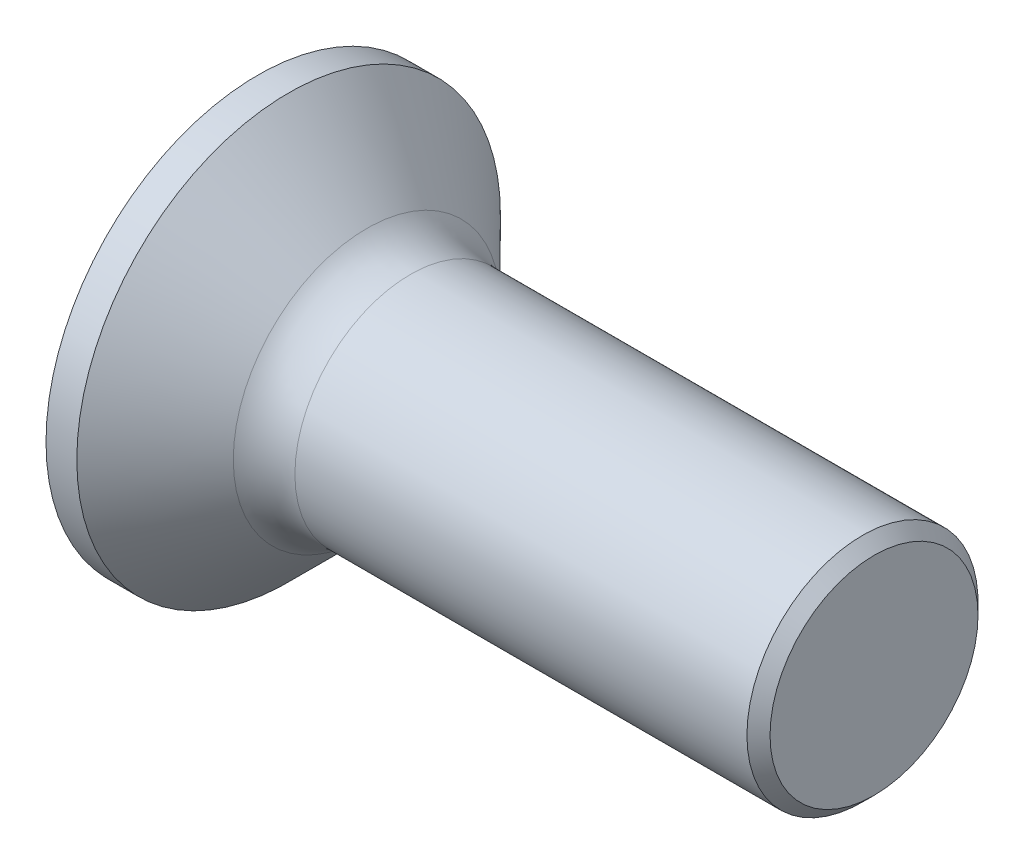
ISO-10303-21;
HEADER;
FILE_DESCRIPTION(('STEP AP214'),'2;1');
FILE_NAME('part.step','',(''),(''),'','','');
FILE_SCHEMA(('AUTOMOTIVE_DESIGN { 1 0 10303 214 1 1 1 1 }'));
ENDSEC;
DATA;
#1=APPLICATION_CONTEXT('core data for automotive mechanical design processes');
#2=APPLICATION_PROTOCOL_DEFINITION('international standard','automotive_design',2000,#1);
#3=PRODUCT_CONTEXT('',#1,'mechanical');
#4=PRODUCT('Part','Part','',(#3));
#5=PRODUCT_RELATED_PRODUCT_CATEGORY('part','',(#4));
#6=PRODUCT_DEFINITION_FORMATION('','',#4);
#7=PRODUCT_DEFINITION_CONTEXT('part definition',#1,'design');
#8=PRODUCT_DEFINITION('design','',#6,#7);
#9=PRODUCT_DEFINITION_SHAPE('','',#8);
#10=(LENGTH_UNIT() NAMED_UNIT(*) SI_UNIT(.MILLI.,.METRE.));
#11=(NAMED_UNIT(*) PLANE_ANGLE_UNIT() SI_UNIT($,.RADIAN.));
#12=(NAMED_UNIT(*) SI_UNIT($,.STERADIAN.) SOLID_ANGLE_UNIT());
#13=UNCERTAINTY_MEASURE_WITH_UNIT(LENGTH_MEASURE(1.E-05),#10,'distance_accuracy_value','');
#14=(GEOMETRIC_REPRESENTATION_CONTEXT(3) GLOBAL_UNCERTAINTY_ASSIGNED_CONTEXT((#13)) GLOBAL_UNIT_ASSIGNED_CONTEXT((#10,
#11,#12)) REPRESENTATION_CONTEXT('',''));
#15=CARTESIAN_POINT('',(0.,0.,0.));
#16=DIRECTION('',(0.,0.,1.));
#17=DIRECTION('',(1.,0.,0.));
#18=AXIS2_PLACEMENT_3D('',#15,#16,#17);
#19=CARTESIAN_POINT('',(0.,0.,-0.425));
#20=DIRECTION('',(0.,0.,1.));
#21=DIRECTION('',(1.,0.,0.));
#22=AXIS2_PLACEMENT_3D('',#19,#20,#21);
#23=PLANE('',#22);
#24=DIRECTION('',(1.,0.,0.));
#25=VECTOR('',#24,1.);
#26=CARTESIAN_POINT('',(0.,-0.419753086419753,-0.425));
#27=LINE('',#26,#25);
#28=CARTESIAN_POINT('',(2.5245,-0.419753086419753,-0.425));
#29=VERTEX_POINT('',#28);
#30=CARTESIAN_POINT('',(1.,-0.419753086419753,-0.425));
#31=VERTEX_POINT('',#30);
#32=EDGE_CURVE('E398',#29,#31,#27,.F.);
#33=ORIENTED_EDGE('',*,*,#32,.T.);
#34=DIRECTION('',(0.,1.,0.));
#35=VECTOR('',#34,1.);
#36=CARTESIAN_POINT('',(1.,0.,-0.425));
#37=LINE('',#36,#35);
#38=CARTESIAN_POINT('',(1.,-0.55003270446328,-0.425));
#39=VERTEX_POINT('',#38);
#40=EDGE_CURVE('E225',#31,#39,#37,.F.);
#41=ORIENTED_EDGE('',*,*,#40,.T.);
#42=DIRECTION('',(1.,0.,0.));
#43=VECTOR('',#42,1.);
#44=CARTESIAN_POINT('',(0.,-0.55003270446328,-0.425));
#45=LINE('',#44,#43);
#46=CARTESIAN_POINT('',(0.,-0.55003270446328,-0.425));
#47=VERTEX_POINT('',#46);
#48=EDGE_CURVE('E199',#39,#47,#45,.F.);
#49=ORIENTED_EDGE('',*,*,#48,.T.);
#50=DIRECTION('',(0.,1.,0.));
#51=VECTOR('',#50,1.);
#52=CARTESIAN_POINT('',(0.,0.,-0.425));
#53=LINE('',#52,#51);
#54=CARTESIAN_POINT('',(0.,-1.7,-0.425));
#55=VERTEX_POINT('',#54);
#56=EDGE_CURVE('E206',#47,#55,#53,.F.);
#57=ORIENTED_EDGE('',*,*,#56,.T.);
#58=DIRECTION('',(1.,0.,0.));
#59=VECTOR('',#58,1.);
#60=CARTESIAN_POINT('',(0.,-1.7,-0.425));
#61=LINE('',#60,#59);
#62=CARTESIAN_POINT('',(0.825,-1.7,-0.425));
#63=VERTEX_POINT('',#62);
#64=EDGE_CURVE('E215',#55,#63,#61,.T.);
#65=ORIENTED_EDGE('',*,*,#64,.T.);
#66=DIRECTION('',(0.799915270195533,0.600112956457372,0.));
#67=VECTOR('',#66,1.);
#68=CARTESIAN_POINT('',(0.825,-1.7,-0.425));
#69=LINE('',#68,#67);
#70=CARTESIAN_POINT('',(2.5245,-0.425,-0.425));
#71=VERTEX_POINT('',#70);
#72=EDGE_CURVE('E392',#63,#71,#69,.T.);
#73=ORIENTED_EDGE('',*,*,#72,.T.);
#74=DIRECTION('',(0.,1.,0.));
#75=VECTOR('',#74,1.);
#76=CARTESIAN_POINT('',(2.5245,0.,-0.425));
#77=LINE('',#76,#75);
#78=EDGE_CURVE('E400',#71,#29,#77,.T.);
#79=ORIENTED_EDGE('',*,*,#78,.T.);
#80=EDGE_LOOP('',(#33,#41,#49,#57,#65,#73,#79));
#81=FACE_BOUND('',#80,.T.);
#82=ADVANCED_FACE('F15',(#81),#23,.T.);
#83=CARTESIAN_POINT('',(0.825,-1.7,0.425));
#84=DIRECTION('',(0.600112956457372,-0.799915270195533,0.));
#85=DIRECTION('',(0.799915270195533,0.600112956457372,0.));
#86=AXIS2_PLACEMENT_3D('',#83,#84,#85);
#87=PLANE('',#86);
#88=DIRECTION('',(0.,0.,1.));
#89=VECTOR('',#88,1.);
#90=CARTESIAN_POINT('',(0.825,-1.7,0.425));
#91=LINE('',#90,#89);
#92=CARTESIAN_POINT('',(0.825,-1.7,0.425));
#93=VERTEX_POINT('',#92);
#94=EDGE_CURVE('E395',#93,#63,#91,.F.);
#95=ORIENTED_EDGE('',*,*,#94,.F.);
#96=DIRECTION('',(0.799915270195533,0.600112956457372,0.));
#97=VECTOR('',#96,1.);
#98=CARTESIAN_POINT('',(0.825,-1.7,0.425));
#99=LINE('',#98,#97);
#100=CARTESIAN_POINT('',(2.5245,-0.425,0.425));
#101=VERTEX_POINT('',#100);
#102=EDGE_CURVE('E383',#93,#101,#99,.T.);
#103=ORIENTED_EDGE('',*,*,#102,.T.);
#104=DIRECTION('',(0.,0.,-1.));
#105=VECTOR('',#104,1.);
#106=CARTESIAN_POINT('',(2.5245,-0.425,0.425));
#107=LINE('',#106,#105);
#108=EDGE_CURVE('E389',#101,#71,#107,.T.);
#109=ORIENTED_EDGE('',*,*,#108,.T.);
#110=ORIENTED_EDGE('',*,*,#72,.F.);
#111=EDGE_LOOP('',(#95,#103,#109,#110));
#112=FACE_BOUND('',#111,.T.);
#113=ADVANCED_FACE('F406',(#112),#87,.F.);
#114=CARTESIAN_POINT('',(2.5245,-0.425,0.425));
#115=DIRECTION('',(1.,0.,0.));
#116=DIRECTION('',(0.,0.,-1.));
#117=AXIS2_PLACEMENT_3D('',#114,#115,#116);
#118=PLANE('',#117);
#119=ORIENTED_EDGE('',*,*,#78,.F.);
#120=ORIENTED_EDGE('',*,*,#108,.F.);
#121=DIRECTION('',(0.,1.,0.));
#122=VECTOR('',#121,1.);
#123=CARTESIAN_POINT('',(2.5245,0.,0.425));
#124=LINE('',#123,#122);
#125=CARTESIAN_POINT('',(2.5245,-0.419753086419753,0.425));
#126=VERTEX_POINT('',#125);
#127=EDGE_CURVE('E381',#101,#126,#124,.T.);
#128=ORIENTED_EDGE('',*,*,#127,.T.);
#129=DIRECTION('',(0.,0.,1.));
#130=VECTOR('',#129,1.);
#131=CARTESIAN_POINT('',(2.5245,-0.419753086419753,0.));
#132=LINE('',#131,#130);
#133=EDGE_CURVE('E357',#29,#126,#132,.T.);
#134=ORIENTED_EDGE('',*,*,#133,.F.);
#135=EDGE_LOOP('',(#119,#120,#128,#134));
#136=FACE_BOUND('',#135,.T.);
#137=ADVANCED_FACE('F411',(#136),#118,.F.);
#138=CARTESIAN_POINT('',(0.,0.,0.425));
#139=DIRECTION('',(0.,0.,1.));
#140=DIRECTION('',(1.,0.,0.));
#141=AXIS2_PLACEMENT_3D('',#138,#139,#140);
#142=PLANE('',#141);
#143=DIRECTION('',(0.,1.,0.));
#144=VECTOR('',#143,1.);
#145=CARTESIAN_POINT('',(1.,0.,0.425));
#146=LINE('',#145,#144);
#147=CARTESIAN_POINT('',(1.,-0.419753086419753,0.425));
#148=VERTEX_POINT('',#147);
#149=CARTESIAN_POINT('',(1.,-0.55003270446328,0.425));
#150=VERTEX_POINT('',#149);
#151=EDGE_CURVE('E379',#148,#150,#146,.F.);
#152=ORIENTED_EDGE('',*,*,#151,.F.);
#153=DIRECTION('',(1.,0.,0.));
#154=VECTOR('',#153,1.);
#155=CARTESIAN_POINT('',(0.,-0.419753086419753,0.425));
#156=LINE('',#155,#154);
#157=EDGE_CURVE('E354',#126,#148,#156,.F.);
#158=ORIENTED_EDGE('',*,*,#157,.F.);
#159=ORIENTED_EDGE('',*,*,#127,.F.);
#160=ORIENTED_EDGE('',*,*,#102,.F.);
#161=DIRECTION('',(1.,0.,0.));
#162=VECTOR('',#161,1.);
#163=CARTESIAN_POINT('',(0.,-1.7,0.425));
#164=LINE('',#163,#162);
#165=CARTESIAN_POINT('',(0.,-1.7,0.425));
#166=VERTEX_POINT('',#165);
#167=EDGE_CURVE('E385',#166,#93,#164,.T.);
#168=ORIENTED_EDGE('',*,*,#167,.F.);
#169=DIRECTION('',(0.,1.,0.));
#170=VECTOR('',#169,1.);
#171=CARTESIAN_POINT('',(0.,0.,0.425));
#172=LINE('',#171,#170);
#173=CARTESIAN_POINT('',(0.,-0.55003270446328,0.425));
#174=VERTEX_POINT('',#173);
#175=EDGE_CURVE('E387',#174,#166,#172,.F.);
#176=ORIENTED_EDGE('',*,*,#175,.F.);
#177=DIRECTION('',(1.,0.,0.));
#178=VECTOR('',#177,1.);
#179=CARTESIAN_POINT('',(0.,-0.55003270446328,0.425));
#180=LINE('',#179,#178);
#181=EDGE_CURVE('E377',#150,#174,#180,.F.);
#182=ORIENTED_EDGE('',*,*,#181,.F.);
#183=EDGE_LOOP('',(#152,#158,#159,#160,#168,#176,#182));
#184=FACE_BOUND('',#183,.T.);
#185=ADVANCED_FACE('F415',(#184),#142,.F.);
#186=CARTESIAN_POINT('',(0.,0.,-0.425));
#187=DIRECTION('',(0.,0.,1.));
#188=DIRECTION('',(1.,0.,0.));
#189=AXIS2_PLACEMENT_3D('',#186,#187,#188);
#190=PLANE('',#189);
#191=DIRECTION('',(1.,0.,0.));
#192=VECTOR('',#191,1.);
#193=CARTESIAN_POINT('',(0.,1.7,-0.425));
#194=LINE('',#193,#192);
#195=CARTESIAN_POINT('',(0.825,1.7,-0.425));
#196=VERTEX_POINT('',#195);
#197=CARTESIAN_POINT('',(0.,1.7,-0.425));
#198=VERTEX_POINT('',#197);
#199=EDGE_CURVE('E363',#196,#198,#194,.F.);
#200=ORIENTED_EDGE('',*,*,#199,.T.);
#201=DIRECTION('',(0.,1.,0.));
#202=VECTOR('',#201,1.);
#203=CARTESIAN_POINT('',(0.,0.,-0.425));
#204=LINE('',#203,#202);
#205=CARTESIAN_POINT('',(0.,0.55003270446328,-0.425));
#206=VERTEX_POINT('',#205);
#207=EDGE_CURVE('E360',#198,#206,#204,.F.);
#208=ORIENTED_EDGE('',*,*,#207,.T.);
#209=DIRECTION('',(1.,0.,0.));
#210=VECTOR('',#209,1.);
#211=CARTESIAN_POINT('',(0.,0.55003270446328,-0.425));
#212=LINE('',#211,#210);
#213=CARTESIAN_POINT('',(1.,0.55003270446328,-0.425));
#214=VERTEX_POINT('',#213);
#215=EDGE_CURVE('E374',#206,#214,#212,.T.);
#216=ORIENTED_EDGE('',*,*,#215,.T.);
#217=DIRECTION('',(0.,1.,0.));
#218=VECTOR('',#217,1.);
#219=CARTESIAN_POINT('',(1.,0.,-0.425));
#220=LINE('',#219,#218);
#221=CARTESIAN_POINT('',(1.,0.419753086419753,-0.425));
#222=VERTEX_POINT('',#221);
#223=EDGE_CURVE('E371',#214,#222,#220,.F.);
#224=ORIENTED_EDGE('',*,*,#223,.T.);
#225=DIRECTION('',(1.,0.,0.));
#226=VECTOR('',#225,1.);
#227=CARTESIAN_POINT('',(0.,0.419753086419753,-0.425));
#228=LINE('',#227,#226);
#229=CARTESIAN_POINT('',(2.5245,0.419753086419753,-0.425));
#230=VERTEX_POINT('',#229);
#231=EDGE_CURVE('E368',#222,#230,#228,.T.);
#232=ORIENTED_EDGE('',*,*,#231,.T.);
#233=DIRECTION('',(0.,1.,0.));
#234=VECTOR('',#233,1.);
#235=CARTESIAN_POINT('',(2.5245,0.,-0.425));
#236=LINE('',#235,#234);
#237=CARTESIAN_POINT('',(2.5245,0.425,-0.425));
#238=VERTEX_POINT('',#237);
#239=EDGE_CURVE('E366',#230,#238,#236,.T.);
#240=ORIENTED_EDGE('',*,*,#239,.T.);
#241=DIRECTION('',(-0.799915270195533,0.600112956457372,0.));
#242=VECTOR('',#241,1.);
#243=CARTESIAN_POINT('',(2.5245,0.425,-0.425));
#244=LINE('',#243,#242);
#245=EDGE_CURVE('E335',#238,#196,#244,.T.);
#246=ORIENTED_EDGE('',*,*,#245,.T.);
#247=EDGE_LOOP('',(#200,#208,#216,#224,#232,#240,#246));
#248=FACE_BOUND('',#247,.T.);
#249=ADVANCED_FACE('F463',(#248),#190,.T.);
#250=CARTESIAN_POINT('',(0.,-0.419753086419753,0.));
#251=DIRECTION('',(0.,1.,0.));
#252=DIRECTION('',(0.,0.,1.));
#253=AXIS2_PLACEMENT_3D('',#250,#251,#252);
#254=PLANE('',#253);
#255=DIRECTION('',(0.,0.,1.));
#256=VECTOR('',#255,1.);
#257=CARTESIAN_POINT('',(0.,-0.419753086419753,0.));
#258=LINE('',#257,#256);
#259=CARTESIAN_POINT('',(0.,-0.419753086419753,-1.7));
#260=VERTEX_POINT('',#259);
#261=CARTESIAN_POINT('',(0.,-0.419753086419753,-0.545630021213276));
#262=VERTEX_POINT('',#261);
#263=EDGE_CURVE('E340',#260,#262,#258,.T.);
#264=ORIENTED_EDGE('',*,*,#263,.T.);
#265=DIRECTION('',(1.,0.,0.));
#266=VECTOR('',#265,1.);
#267=CARTESIAN_POINT('',(0.,-0.419753086419753,-0.545630021213276));
#268=LINE('',#267,#266);
#269=CARTESIAN_POINT('',(1.,-0.419753086419753,-0.545630021213276));
#270=VERTEX_POINT('',#269);
#271=EDGE_CURVE('E338',#262,#270,#268,.T.);
#272=ORIENTED_EDGE('',*,*,#271,.T.);
#273=DIRECTION('',(0.,0.,1.));
#274=VECTOR('',#273,1.);
#275=CARTESIAN_POINT('',(1.,-0.419753086419753,0.));
#276=LINE('',#275,#274);
#277=EDGE_CURVE('E329',#31,#270,#276,.F.);
#278=ORIENTED_EDGE('',*,*,#277,.F.);
#279=ORIENTED_EDGE('',*,*,#32,.F.);
#280=ORIENTED_EDGE('',*,*,#133,.T.);
#281=ORIENTED_EDGE('',*,*,#157,.T.);
#282=DIRECTION('',(0.,0.,1.));
#283=VECTOR('',#282,1.);
#284=CARTESIAN_POINT('',(1.,-0.419753086419753,0.));
#285=LINE('',#284,#283);
#286=CARTESIAN_POINT('',(1.,-0.419753086419753,0.545630021213276));
#287=VERTEX_POINT('',#286);
#288=EDGE_CURVE('E332',#287,#148,#285,.F.);
#289=ORIENTED_EDGE('',*,*,#288,.F.);
#290=DIRECTION('',(1.,0.,0.));
#291=VECTOR('',#290,1.);
#292=CARTESIAN_POINT('',(0.,-0.419753086419753,0.545630021213276));
#293=LINE('',#292,#291);
#294=CARTESIAN_POINT('',(0.,-0.419753086419753,0.545630021213276));
#295=VERTEX_POINT('',#294);
#296=EDGE_CURVE('E351',#287,#295,#293,.F.);
#297=ORIENTED_EDGE('',*,*,#296,.T.);
#298=DIRECTION('',(0.,0.,1.));
#299=VECTOR('',#298,1.);
#300=CARTESIAN_POINT('',(0.,-0.419753086419753,0.));
#301=LINE('',#300,#299);
#302=CARTESIAN_POINT('',(0.,-0.419753086419753,1.7));
#303=VERTEX_POINT('',#302);
#304=EDGE_CURVE('E348',#295,#303,#301,.T.);
#305=ORIENTED_EDGE('',*,*,#304,.T.);
#306=DIRECTION('',(1.,0.,0.));
#307=VECTOR('',#306,1.);
#308=CARTESIAN_POINT('',(0.,-0.419753086419753,1.7));
#309=LINE('',#308,#307);
#310=CARTESIAN_POINT('',(0.825,-0.419753086419753,1.7));
#311=VERTEX_POINT('',#310);
#312=EDGE_CURVE('E346',#303,#311,#309,.T.);
#313=ORIENTED_EDGE('',*,*,#312,.T.);
#314=DIRECTION('',(0.802769432970874,0.,-0.596289558425788));
#315=VECTOR('',#314,1.);
#316=CARTESIAN_POINT('',(0.825,-0.419753086419753,1.7));
#317=LINE('',#316,#315);
#318=CARTESIAN_POINT('',(2.5415,-0.419753086419753,0.425));
#319=VERTEX_POINT('',#318);
#320=EDGE_CURVE('E325',#311,#319,#317,.T.);
#321=ORIENTED_EDGE('',*,*,#320,.T.);
#322=DIRECTION('',(0.,0.,-1.));
#323=VECTOR('',#322,1.);
#324=CARTESIAN_POINT('',(2.5415,-0.419753086419753,0.425));
#325=LINE('',#324,#323);
#326=CARTESIAN_POINT('',(2.5415,-0.419753086419753,-0.425));
#327=VERTEX_POINT('',#326);
#328=EDGE_CURVE('E320',#319,#327,#325,.T.);
#329=ORIENTED_EDGE('',*,*,#328,.T.);
#330=DIRECTION('',(-0.802769432970874,0.,-0.596289558425788));
#331=VECTOR('',#330,1.);
#332=CARTESIAN_POINT('',(2.5415,-0.419753086419753,-0.425));
#333=LINE('',#332,#331);
#334=CARTESIAN_POINT('',(0.825,-0.419753086419753,-1.7));
#335=VERTEX_POINT('',#334);
#336=EDGE_CURVE('E314',#327,#335,#333,.T.);
#337=ORIENTED_EDGE('',*,*,#336,.T.);
#338=DIRECTION('',(1.,0.,0.));
#339=VECTOR('',#338,1.);
#340=CARTESIAN_POINT('',(0.,-0.419753086419753,-1.7));
#341=LINE('',#340,#339);
#342=EDGE_CURVE('E343',#335,#260,#341,.F.);
#343=ORIENTED_EDGE('',*,*,#342,.T.);
#344=EDGE_LOOP('',(#264,#272,#278,#279,#280,#281,#289,#297,#305,#313,#321,#329,#337,#343));
#345=FACE_BOUND('',#344,.T.);
#346=ADVANCED_FACE('F420',(#345),#254,.T.);
#347=CARTESIAN_POINT('',(2.5245,0.425,0.425));
#348=DIRECTION('',(0.600112956457372,0.799915270195533,0.));
#349=DIRECTION('',(-0.799915270195533,0.600112956457372,0.));
#350=AXIS2_PLACEMENT_3D('',#347,#348,#349);
#351=PLANE('',#350);
#352=DIRECTION('',(0.,0.,-1.));
#353=VECTOR('',#352,1.);
#354=CARTESIAN_POINT('',(2.5245,0.425,0.425));
#355=LINE('',#354,#353);
#356=CARTESIAN_POINT('',(2.5245,0.425,0.425));
#357=VERTEX_POINT('',#356);
#358=EDGE_CURVE('E327',#238,#357,#355,.F.);
#359=ORIENTED_EDGE('',*,*,#358,.T.);
#360=DIRECTION('',(-0.799915270195533,0.600112956457372,0.));
#361=VECTOR('',#360,1.);
#362=CARTESIAN_POINT('',(2.5245,0.425,0.425));
#363=LINE('',#362,#361);
#364=CARTESIAN_POINT('',(0.825,1.7,0.425));
#365=VERTEX_POINT('',#364);
#366=EDGE_CURVE('E302',#357,#365,#363,.T.);
#367=ORIENTED_EDGE('',*,*,#366,.T.);
#368=DIRECTION('',(0.,0.,1.));
#369=VECTOR('',#368,1.);
#370=CARTESIAN_POINT('',(0.825,1.7,0.425));
#371=LINE('',#370,#369);
#372=EDGE_CURVE('E309',#365,#196,#371,.F.);
#373=ORIENTED_EDGE('',*,*,#372,.T.);
#374=ORIENTED_EDGE('',*,*,#245,.F.);
#375=EDGE_LOOP('',(#359,#367,#373,#374));
#376=FACE_BOUND('',#375,.T.);
#377=ADVANCED_FACE('F590',(#376),#351,.F.);
#378=CARTESIAN_POINT('',(1.,0.,0.));
#379=DIRECTION('',(-1.,0.,0.));
#380=DIRECTION('',(0.,0.,1.));
#381=AXIS2_PLACEMENT_3D('',#378,#379,#380);
#382=PLANE('',#381);
#383=DIRECTION('',(0.,-0.766044443118978,0.642787609686539));
#384=VECTOR('',#383,1.);
#385=CARTESIAN_POINT('',(1.,-1.20208152801713,1.20208152801713));
#386=LINE('',#385,#384);
#387=CARTESIAN_POINT('',(1.,-1.20208152801713,1.20208152801713));
#388=VERTEX_POINT('',#387);
#389=EDGE_CURVE('E287',#388,#287,#386,.F.);
#390=ORIENTED_EDGE('',*,*,#389,.T.);
#391=ORIENTED_EDGE('',*,*,#288,.T.);
#392=ORIENTED_EDGE('',*,*,#151,.T.);
#393=DIRECTION('',(0.,0.642787609686539,-0.766044443118978));
#394=VECTOR('',#393,1.);
#395=CARTESIAN_POINT('',(1.,-0.193415361212936,0.));
#396=LINE('',#395,#394);
#397=EDGE_CURVE('E285',#150,#388,#396,.F.);
#398=ORIENTED_EDGE('',*,*,#397,.T.);
#399=EDGE_LOOP('',(#390,#391,#392,#398));
#400=FACE_BOUND('',#399,.T.);
#401=ADVANCED_FACE('F587',(#400),#382,.T.);
#402=CARTESIAN_POINT('',(1.,0.,0.));
#403=DIRECTION('',(-1.,0.,0.));
#404=DIRECTION('',(0.,0.,1.));
#405=AXIS2_PLACEMENT_3D('',#402,#403,#404);
#406=PLANE('',#405);
#407=DIRECTION('',(0.,0.766044443118978,0.642787609686539));
#408=VECTOR('',#407,1.);
#409=CARTESIAN_POINT('',(1.,0.,-0.193415361212936));
#410=LINE('',#409,#408);
#411=CARTESIAN_POINT('',(1.,-1.20208152801713,-1.20208152801713));
#412=VERTEX_POINT('',#411);
#413=EDGE_CURVE('E279',#270,#412,#410,.F.);
#414=ORIENTED_EDGE('',*,*,#413,.T.);
#415=DIRECTION('',(0.,-0.642787609686539,-0.766044443118978));
#416=VECTOR('',#415,1.);
#417=CARTESIAN_POINT('',(1.,-1.20208152801713,-1.20208152801713));
#418=LINE('',#417,#416);
#419=EDGE_CURVE('E281',#412,#39,#418,.F.);
#420=ORIENTED_EDGE('',*,*,#419,.T.);
#421=ORIENTED_EDGE('',*,*,#40,.F.);
#422=ORIENTED_EDGE('',*,*,#277,.T.);
#423=EDGE_LOOP('',(#414,#420,#421,#422));
#424=FACE_BOUND('',#423,.T.);
#425=ADVANCED_FACE('F424',(#424),#406,.T.);
#426=CARTESIAN_POINT('',(2.5245,-0.425,0.425));
#427=DIRECTION('',(1.,0.,0.));
#428=DIRECTION('',(0.,0.,-1.));
#429=AXIS2_PLACEMENT_3D('',#426,#427,#428);
#430=PLANE('',#429);
#431=DIRECTION('',(0.,1.,0.));
#432=VECTOR('',#431,1.);
#433=CARTESIAN_POINT('',(2.5245,0.,0.425));
#434=LINE('',#433,#432);
#435=CARTESIAN_POINT('',(2.5245,0.419753086419753,0.425));
#436=VERTEX_POINT('',#435);
#437=EDGE_CURVE('E304',#436,#357,#434,.T.);
#438=ORIENTED_EDGE('',*,*,#437,.T.);
#439=ORIENTED_EDGE('',*,*,#358,.F.);
#440=ORIENTED_EDGE('',*,*,#239,.F.);
#441=DIRECTION('',(0.,0.,1.));
#442=VECTOR('',#441,1.);
#443=CARTESIAN_POINT('',(2.5245,0.419753086419753,0.));
#444=LINE('',#443,#442);
#445=EDGE_CURVE('E273',#230,#436,#444,.T.);
#446=ORIENTED_EDGE('',*,*,#445,.T.);
#447=EDGE_LOOP('',(#438,#439,#440,#446));
#448=FACE_BOUND('',#447,.T.);
#449=ADVANCED_FACE('F580',(#448),#430,.F.);
#450=CARTESIAN_POINT('',(1.,0.,0.));
#451=DIRECTION('',(-1.,0.,0.));
#452=DIRECTION('',(0.,0.,1.));
#453=AXIS2_PLACEMENT_3D('',#450,#451,#452);
#454=PLANE('',#453);
#455=DIRECTION('',(0.,-0.766044443118978,-0.642787609686539));
#456=VECTOR('',#455,1.);
#457=CARTESIAN_POINT('',(1.,0.,0.193415361212936));
#458=LINE('',#457,#456);
#459=CARTESIAN_POINT('',(1.,0.419753086419753,0.545630021213276));
#460=VERTEX_POINT('',#459);
#461=CARTESIAN_POINT('',(1.,1.20208152801713,1.20208152801713));
#462=VERTEX_POINT('',#461);
#463=EDGE_CURVE('E294',#460,#462,#458,.F.);
#464=ORIENTED_EDGE('',*,*,#463,.T.);
#465=DIRECTION('',(0.,0.642787609686539,0.766044443118978));
#466=VECTOR('',#465,1.);
#467=CARTESIAN_POINT('',(1.,1.20208152801713,1.20208152801713));
#468=LINE('',#467,#466);
#469=CARTESIAN_POINT('',(1.,0.55003270446328,0.425));
#470=VERTEX_POINT('',#469);
#471=EDGE_CURVE('E298',#462,#470,#468,.F.);
#472=ORIENTED_EDGE('',*,*,#471,.T.);
#473=DIRECTION('',(0.,1.,0.));
#474=VECTOR('',#473,1.);
#475=CARTESIAN_POINT('',(1.,0.,0.425));
#476=LINE('',#475,#474);
#477=CARTESIAN_POINT('',(1.,0.419753086419753,0.425));
#478=VERTEX_POINT('',#477);
#479=EDGE_CURVE('E307',#470,#478,#476,.F.);
#480=ORIENTED_EDGE('',*,*,#479,.T.);
#481=DIRECTION('',(0.,0.,1.));
#482=VECTOR('',#481,1.);
#483=CARTESIAN_POINT('',(1.,0.419753086419753,0.));
#484=LINE('',#483,#482);
#485=EDGE_CURVE('E268',#478,#460,#484,.T.);
#486=ORIENTED_EDGE('',*,*,#485,.T.);
#487=EDGE_LOOP('',(#464,#472,#480,#486));
#488=FACE_BOUND('',#487,.T.);
#489=ADVANCED_FACE('F577',(#488),#454,.T.);
#490=CARTESIAN_POINT('',(0.825,0.419753086419753,1.7));
#491=DIRECTION('',(0.596289558425788,0.,0.802769432970874));
#492=DIRECTION('',(0.802769432970874,0.,-0.596289558425788));
#493=AXIS2_PLACEMENT_3D('',#490,#491,#492);
#494=PLANE('',#493);
#495=DIRECTION('',(0.,1.,0.));
#496=VECTOR('',#495,1.);
#497=CARTESIAN_POINT('',(0.825,0.419753086419753,1.7));
#498=LINE('',#497,#496);
#499=CARTESIAN_POINT('',(0.825,0.419753086419753,1.7));
#500=VERTEX_POINT('',#499);
#501=EDGE_CURVE('E290',#311,#500,#498,.T.);
#502=ORIENTED_EDGE('',*,*,#501,.T.);
#503=DIRECTION('',(0.802769432970874,0.,-0.596289558425788));
#504=VECTOR('',#503,1.);
#505=CARTESIAN_POINT('',(0.825,0.419753086419753,1.7));
#506=LINE('',#505,#504);
#507=CARTESIAN_POINT('',(2.5415,0.419753086419753,0.425));
#508=VERTEX_POINT('',#507);
#509=EDGE_CURVE('E261',#500,#508,#506,.T.);
#510=ORIENTED_EDGE('',*,*,#509,.T.);
#511=DIRECTION('',(0.,1.,0.));
#512=VECTOR('',#511,1.);
#513=CARTESIAN_POINT('',(2.5415,0.419753086419753,0.425));
#514=LINE('',#513,#512);
#515=EDGE_CURVE('E322',#508,#319,#514,.F.);
#516=ORIENTED_EDGE('',*,*,#515,.T.);
#517=ORIENTED_EDGE('',*,*,#320,.F.);
#518=EDGE_LOOP('',(#502,#510,#516,#517));
#519=FACE_BOUND('',#518,.T.);
#520=ADVANCED_FACE('F546',(#519),#494,.F.);
#521=CARTESIAN_POINT('',(2.5415,0.419753086419753,0.425));
#522=DIRECTION('',(1.,0.,0.));
#523=DIRECTION('',(0.,0.,-1.));
#524=AXIS2_PLACEMENT_3D('',#521,#522,#523);
#525=PLANE('',#524);
#526=ORIENTED_EDGE('',*,*,#515,.F.);
#527=DIRECTION('',(0.,0.,1.));
#528=VECTOR('',#527,1.);
#529=CARTESIAN_POINT('',(2.5415,0.419753086419753,0.));
#530=LINE('',#529,#528);
#531=CARTESIAN_POINT('',(2.5415,0.419753086419753,-0.425));
#532=VERTEX_POINT('',#531);
#533=EDGE_CURVE('E259',#508,#532,#530,.F.);
#534=ORIENTED_EDGE('',*,*,#533,.T.);
#535=DIRECTION('',(0.,1.,0.));
#536=VECTOR('',#535,1.);
#537=CARTESIAN_POINT('',(2.5415,0.419753086419753,-0.425));
#538=LINE('',#537,#536);
#539=EDGE_CURVE('E317',#532,#327,#538,.F.);
#540=ORIENTED_EDGE('',*,*,#539,.T.);
#541=ORIENTED_EDGE('',*,*,#328,.F.);
#542=EDGE_LOOP('',(#526,#534,#540,#541));
#543=FACE_BOUND('',#542,.T.);
#544=ADVANCED_FACE('F544',(#543),#525,.F.);
#545=CARTESIAN_POINT('',(2.5415,0.419753086419753,-0.425));
#546=DIRECTION('',(0.596289558425788,0.,-0.802769432970874));
#547=DIRECTION('',(-0.802769432970874,0.,-0.596289558425788));
#548=AXIS2_PLACEMENT_3D('',#545,#546,#547);
#549=PLANE('',#548);
#550=ORIENTED_EDGE('',*,*,#539,.F.);
#551=DIRECTION('',(-0.802769432970874,0.,-0.596289558425788));
#552=VECTOR('',#551,1.);
#553=CARTESIAN_POINT('',(2.5415,0.419753086419753,-0.425));
#554=LINE('',#553,#552);
#555=CARTESIAN_POINT('',(0.825,0.419753086419753,-1.7));
#556=VERTEX_POINT('',#555);
#557=EDGE_CURVE('E257',#532,#556,#554,.T.);
#558=ORIENTED_EDGE('',*,*,#557,.T.);
#559=DIRECTION('',(0.,1.,0.));
#560=VECTOR('',#559,1.);
#561=CARTESIAN_POINT('',(0.825,0.419753086419753,-1.7));
#562=LINE('',#561,#560);
#563=EDGE_CURVE('E275',#556,#335,#562,.F.);
#564=ORIENTED_EDGE('',*,*,#563,.T.);
#565=ORIENTED_EDGE('',*,*,#336,.F.);
#566=EDGE_LOOP('',(#550,#558,#564,#565));
#567=FACE_BOUND('',#566,.T.);
#568=ADVANCED_FACE('F540',(#567),#549,.F.);
#569=CARTESIAN_POINT('',(1.,0.,0.));
#570=DIRECTION('',(-1.,0.,0.));
#571=DIRECTION('',(0.,0.,1.));
#572=AXIS2_PLACEMENT_3D('',#569,#570,#571);
#573=PLANE('',#572);
#574=DIRECTION('',(0.,0.766044443118978,-0.642787609686539));
#575=VECTOR('',#574,1.);
#576=CARTESIAN_POINT('',(1.,1.20208152801713,-1.20208152801713));
#577=LINE('',#576,#575);
#578=CARTESIAN_POINT('',(1.,1.20208152801713,-1.20208152801713));
#579=VERTEX_POINT('',#578);
#580=CARTESIAN_POINT('',(1.,0.419753086419753,-0.545630021213276));
#581=VERTEX_POINT('',#580);
#582=EDGE_CURVE('E247',#579,#581,#577,.F.);
#583=ORIENTED_EDGE('',*,*,#582,.T.);
#584=DIRECTION('',(0.,0.,1.));
#585=VECTOR('',#584,1.);
#586=CARTESIAN_POINT('',(1.,0.419753086419753,0.));
#587=LINE('',#586,#585);
#588=EDGE_CURVE('E252',#581,#222,#587,.T.);
#589=ORIENTED_EDGE('',*,*,#588,.T.);
#590=ORIENTED_EDGE('',*,*,#223,.F.);
#591=DIRECTION('',(0.,-0.642787609686539,0.766044443118978));
#592=VECTOR('',#591,1.);
#593=CARTESIAN_POINT('',(1.,0.193415361212936,0.));
#594=LINE('',#593,#592);
#595=EDGE_CURVE('E312',#214,#579,#594,.F.);
#596=ORIENTED_EDGE('',*,*,#595,.T.);
#597=EDGE_LOOP('',(#583,#589,#590,#596));
#598=FACE_BOUND('',#597,.T.);
#599=ADVANCED_FACE('F567',(#598),#573,.T.);
#600=CARTESIAN_POINT('',(0.,0.193415361212936,0.));
#601=DIRECTION('',(0.,0.766044443118978,0.642787609686539));
#602=DIRECTION('',(0.,-0.642787609686539,0.766044443118978));
#603=AXIS2_PLACEMENT_3D('',#600,#601,#602);
#604=PLANE('',#603);
#605=DIRECTION('',(0.,-0.642787609686539,0.766044443118978));
#606=VECTOR('',#605,1.);
#607=CARTESIAN_POINT('',(0.,1.20208152801713,-1.20208152801713));
#608=LINE('',#607,#606);
#609=CARTESIAN_POINT('',(0.,1.20208152801713,-1.20208152801713));
#610=VERTEX_POINT('',#609);
#611=EDGE_CURVE('E244',#610,#206,#608,.T.);
#612=ORIENTED_EDGE('',*,*,#611,.F.);
#613=DIRECTION('',(1.,0.,0.));
#614=VECTOR('',#613,1.);
#615=CARTESIAN_POINT('',(0.,1.20208152801713,-1.20208152801713));
#616=LINE('',#615,#614);
#617=EDGE_CURVE('E249',#610,#579,#616,.T.);
#618=ORIENTED_EDGE('',*,*,#617,.T.);
#619=ORIENTED_EDGE('',*,*,#595,.F.);
#620=ORIENTED_EDGE('',*,*,#215,.F.);
#621=EDGE_LOOP('',(#612,#618,#619,#620));
#622=FACE_BOUND('',#621,.T.);
#623=ADVANCED_FACE('F564',(#622),#604,.F.);
#624=CARTESIAN_POINT('',(0.825,1.7,0.425));
#625=DIRECTION('',(0.,1.,0.));
#626=DIRECTION('',(0.,0.,1.));
#627=AXIS2_PLACEMENT_3D('',#624,#625,#626);
#628=PLANE('',#627);
#629=ORIENTED_EDGE('',*,*,#199,.F.);
#630=ORIENTED_EDGE('',*,*,#372,.F.);
#631=DIRECTION('',(1.,0.,0.));
#632=VECTOR('',#631,1.);
#633=CARTESIAN_POINT('',(0.,1.7,0.425));
#634=LINE('',#633,#632);
#635=CARTESIAN_POINT('',(0.,1.7,0.425));
#636=VERTEX_POINT('',#635);
#637=EDGE_CURVE('E300',#365,#636,#634,.F.);
#638=ORIENTED_EDGE('',*,*,#637,.T.);
#639=DIRECTION('',(0.,0.,1.));
#640=VECTOR('',#639,1.);
#641=CARTESIAN_POINT('',(0.,1.7,-1.375));
#642=LINE('',#641,#640);
#643=EDGE_CURVE('E455',#198,#636,#642,.T.);
#644=ORIENTED_EDGE('',*,*,#643,.F.);
#645=EDGE_LOOP('',(#629,#630,#638,#644));
#646=FACE_BOUND('',#645,.T.);
#647=ADVANCED_FACE('F467',(#646),#628,.F.);
#648=CARTESIAN_POINT('',(0.,0.,0.425));
#649=DIRECTION('',(0.,0.,1.));
#650=DIRECTION('',(1.,0.,0.));
#651=AXIS2_PLACEMENT_3D('',#648,#649,#650);
#652=PLANE('',#651);
#653=DIRECTION('',(0.,1.,0.));
#654=VECTOR('',#653,1.);
#655=CARTESIAN_POINT('',(0.,0.,0.425));
#656=LINE('',#655,#654);
#657=CARTESIAN_POINT('',(0.,0.55003270446328,0.425));
#658=VERTEX_POINT('',#657);
#659=EDGE_CURVE('E453',#636,#658,#656,.F.);
#660=ORIENTED_EDGE('',*,*,#659,.F.);
#661=ORIENTED_EDGE('',*,*,#637,.F.);
#662=ORIENTED_EDGE('',*,*,#366,.F.);
#663=ORIENTED_EDGE('',*,*,#437,.F.);
#664=DIRECTION('',(1.,0.,0.));
#665=VECTOR('',#664,1.);
#666=CARTESIAN_POINT('',(0.,0.419753086419753,0.425));
#667=LINE('',#666,#665);
#668=EDGE_CURVE('E270',#436,#478,#667,.F.);
#669=ORIENTED_EDGE('',*,*,#668,.T.);
#670=ORIENTED_EDGE('',*,*,#479,.F.);
#671=DIRECTION('',(1.,0.,0.));
#672=VECTOR('',#671,1.);
#673=CARTESIAN_POINT('',(0.,0.55003270446328,0.425));
#674=LINE('',#673,#672);
#675=EDGE_CURVE('E296',#470,#658,#674,.F.);
#676=ORIENTED_EDGE('',*,*,#675,.T.);
#677=EDGE_LOOP('',(#660,#661,#662,#663,#669,#670,#676));
#678=FACE_BOUND('',#677,.T.);
#679=ADVANCED_FACE('F472',(#678),#652,.F.);
#680=CARTESIAN_POINT('',(0.,1.20208152801713,1.20208152801713));
#681=DIRECTION('',(0.,0.766044443118978,-0.642787609686539));
#682=DIRECTION('',(0.,0.642787609686539,0.766044443118978));
#683=AXIS2_PLACEMENT_3D('',#680,#681,#682);
#684=PLANE('',#683);
#685=ORIENTED_EDGE('',*,*,#471,.F.);
#686=DIRECTION('',(1.,0.,0.));
#687=VECTOR('',#686,1.);
#688=CARTESIAN_POINT('',(0.,1.20208152801713,1.20208152801713));
#689=LINE('',#688,#687);
#690=CARTESIAN_POINT('',(0.,1.20208152801713,1.20208152801713));
#691=VERTEX_POINT('',#690);
#692=EDGE_CURVE('E292',#462,#691,#689,.F.);
#693=ORIENTED_EDGE('',*,*,#692,.T.);
#694=DIRECTION('',(0.,0.642787609686539,0.766044443118978));
#695=VECTOR('',#694,1.);
#696=CARTESIAN_POINT('',(0.,0.55003270446328,0.425));
#697=LINE('',#696,#695);
#698=EDGE_CURVE('E450',#658,#691,#697,.T.);
#699=ORIENTED_EDGE('',*,*,#698,.F.);
#700=ORIENTED_EDGE('',*,*,#675,.F.);
#701=EDGE_LOOP('',(#685,#693,#699,#700));
#702=FACE_BOUND('',#701,.T.);
#703=ADVANCED_FACE('F479',(#702),#684,.F.);
#704=CARTESIAN_POINT('',(0.,0.,0.193415361212936));
#705=DIRECTION('',(0.,-0.642787609686539,0.766044443118978));
#706=DIRECTION('',(0.,-0.766044443118978,-0.642787609686539));
#707=AXIS2_PLACEMENT_3D('',#704,#705,#706);
#708=PLANE('',#707);
#709=DIRECTION('',(0.,-0.766044443118978,-0.642787609686539));
#710=VECTOR('',#709,1.);
#711=CARTESIAN_POINT('',(0.,1.20208152801713,1.20208152801713));
#712=LINE('',#711,#710);
#713=CARTESIAN_POINT('',(0.,0.419753086419753,0.545630021213276));
#714=VERTEX_POINT('',#713);
#715=EDGE_CURVE('E447',#691,#714,#712,.T.);
#716=ORIENTED_EDGE('',*,*,#715,.F.);
#717=ORIENTED_EDGE('',*,*,#692,.F.);
#718=ORIENTED_EDGE('',*,*,#463,.F.);
#719=DIRECTION('',(1.,0.,0.));
#720=VECTOR('',#719,1.);
#721=CARTESIAN_POINT('',(0.,0.419753086419753,0.545630021213276));
#722=LINE('',#721,#720);
#723=EDGE_CURVE('E266',#460,#714,#722,.F.);
#724=ORIENTED_EDGE('',*,*,#723,.T.);
#725=EDGE_LOOP('',(#716,#717,#718,#724));
#726=FACE_BOUND('',#725,.T.);
#727=ADVANCED_FACE('F483',(#726),#708,.F.);
#728=CARTESIAN_POINT('',(-1.,0.419753086419753,1.7));
#729=DIRECTION('',(0.,0.,1.));
#730=DIRECTION('',(1.,0.,0.));
#731=AXIS2_PLACEMENT_3D('',#728,#729,#730);
#732=PLANE('',#731);
#733=DIRECTION('',(1.,0.,0.));
#734=VECTOR('',#733,1.);
#735=CARTESIAN_POINT('',(0.,0.419753086419753,1.7));
#736=LINE('',#735,#734);
#737=CARTESIAN_POINT('',(0.,0.419753086419753,1.7));
#738=VERTEX_POINT('',#737);
#739=EDGE_CURVE('E263',#738,#500,#736,.T.);
#740=ORIENTED_EDGE('',*,*,#739,.T.);
#741=ORIENTED_EDGE('',*,*,#501,.F.);
#742=ORIENTED_EDGE('',*,*,#312,.F.);
#743=DIRECTION('',(0.,1.,0.));
#744=VECTOR('',#743,1.);
#745=CARTESIAN_POINT('',(0.,0.,1.7));
#746=LINE('',#745,#744);
#747=EDGE_CURVE('E441',#738,#303,#746,.F.);
#748=ORIENTED_EDGE('',*,*,#747,.F.);
#749=EDGE_LOOP('',(#740,#741,#742,#748));
#750=FACE_BOUND('',#749,.T.);
#751=ADVANCED_FACE('F548',(#750),#732,.F.);
#752=CARTESIAN_POINT('',(0.,-1.20208152801713,1.20208152801713));
#753=DIRECTION('',(0.,0.642787609686539,0.766044443118978));
#754=DIRECTION('',(0.,-0.766044443118978,0.642787609686539));
#755=AXIS2_PLACEMENT_3D('',#752,#753,#754);
#756=PLANE('',#755);
#757=ORIENTED_EDGE('',*,*,#389,.F.);
#758=DIRECTION('',(1.,0.,0.));
#759=VECTOR('',#758,1.);
#760=CARTESIAN_POINT('',(0.,-1.20208152801713,1.20208152801713));
#761=LINE('',#760,#759);
#762=CARTESIAN_POINT('',(0.,-1.20208152801713,1.20208152801713));
#763=VERTEX_POINT('',#762);
#764=EDGE_CURVE('E283',#388,#763,#761,.F.);
#765=ORIENTED_EDGE('',*,*,#764,.T.);
#766=DIRECTION('',(0.,-0.766044443118978,0.642787609686539));
#767=VECTOR('',#766,1.);
#768=CARTESIAN_POINT('',(0.,-0.419753086419753,0.545630021213276));
#769=LINE('',#768,#767);
#770=EDGE_CURVE('E438',#295,#763,#769,.T.);
#771=ORIENTED_EDGE('',*,*,#770,.F.);
#772=ORIENTED_EDGE('',*,*,#296,.F.);
#773=EDGE_LOOP('',(#757,#765,#771,#772));
#774=FACE_BOUND('',#773,.T.);
#775=ADVANCED_FACE('F495',(#774),#756,.F.);
#776=CARTESIAN_POINT('',(0.,-0.193415361212936,0.));
#777=DIRECTION('',(0.,-0.766044443118978,-0.642787609686539));
#778=DIRECTION('',(0.,0.642787609686539,-0.766044443118978));
#779=AXIS2_PLACEMENT_3D('',#776,#777,#778);
#780=PLANE('',#779);
#781=DIRECTION('',(0.,0.642787609686539,-0.766044443118978));
#782=VECTOR('',#781,1.);
#783=CARTESIAN_POINT('',(0.,-1.20208152801713,1.20208152801713));
#784=LINE('',#783,#782);
#785=EDGE_CURVE('E435',#763,#174,#784,.T.);
#786=ORIENTED_EDGE('',*,*,#785,.F.);
#787=ORIENTED_EDGE('',*,*,#764,.F.);
#788=ORIENTED_EDGE('',*,*,#397,.F.);
#789=ORIENTED_EDGE('',*,*,#181,.T.);
#790=EDGE_LOOP('',(#786,#787,#788,#789));
#791=FACE_BOUND('',#790,.T.);
#792=ADVANCED_FACE('F502',(#791),#780,.F.);
#793=CARTESIAN_POINT('',(-1.,-1.7,0.425));
#794=DIRECTION('',(0.,-1.,0.));
#795=DIRECTION('',(0.,0.,-1.));
#796=AXIS2_PLACEMENT_3D('',#793,#794,#795);
#797=PLANE('',#796);
#798=ORIENTED_EDGE('',*,*,#167,.T.);
#799=ORIENTED_EDGE('',*,*,#94,.T.);
#800=ORIENTED_EDGE('',*,*,#64,.F.);
#801=DIRECTION('',(0.,0.,1.));
#802=VECTOR('',#801,1.);
#803=CARTESIAN_POINT('',(0.,-1.7,-1.375));
#804=LINE('',#803,#802);
#805=EDGE_CURVE('E212',#166,#55,#804,.F.);
#806=ORIENTED_EDGE('',*,*,#805,.F.);
#807=EDGE_LOOP('',(#798,#799,#800,#806));
#808=FACE_BOUND('',#807,.T.);
#809=ADVANCED_FACE('F500',(#808),#797,.F.);
#810=CARTESIAN_POINT('',(0.,-1.20208152801713,-1.20208152801713));
#811=DIRECTION('',(0.,-0.766044443118978,0.642787609686539));
#812=DIRECTION('',(0.,-0.642787609686539,-0.766044443118978));
#813=AXIS2_PLACEMENT_3D('',#810,#811,#812);
#814=PLANE('',#813);
#815=ORIENTED_EDGE('',*,*,#419,.F.);
#816=DIRECTION('',(1.,0.,0.));
#817=VECTOR('',#816,1.);
#818=CARTESIAN_POINT('',(0.,-1.20208152801713,-1.20208152801713));
#819=LINE('',#818,#817);
#820=CARTESIAN_POINT('',(0.,-1.20208152801713,-1.20208152801713));
#821=VERTEX_POINT('',#820);
#822=EDGE_CURVE('E219',#412,#821,#819,.F.);
#823=ORIENTED_EDGE('',*,*,#822,.T.);
#824=DIRECTION('',(0.,-0.642787609686539,-0.766044443118978));
#825=VECTOR('',#824,1.);
#826=CARTESIAN_POINT('',(0.,-0.55003270446328,-0.425));
#827=LINE('',#826,#825);
#828=EDGE_CURVE('E210',#47,#821,#827,.T.);
#829=ORIENTED_EDGE('',*,*,#828,.F.);
#830=ORIENTED_EDGE('',*,*,#48,.F.);
#831=EDGE_LOOP('',(#815,#823,#829,#830));
#832=FACE_BOUND('',#831,.T.);
#833=ADVANCED_FACE('F217',(#832),#814,.F.);
#834=CARTESIAN_POINT('',(0.,0.,-0.193415361212936));
#835=DIRECTION('',(0.,0.642787609686539,-0.766044443118978));
#836=DIRECTION('',(0.,0.766044443118978,0.642787609686539));
#837=AXIS2_PLACEMENT_3D('',#834,#835,#836);
#838=PLANE('',#837);
#839=DIRECTION('',(0.,0.766044443118978,0.642787609686539));
#840=VECTOR('',#839,1.);
#841=CARTESIAN_POINT('',(0.,-1.20208152801713,-1.20208152801713));
#842=LINE('',#841,#840);
#843=EDGE_CURVE('E221',#821,#262,#842,.T.);
#844=ORIENTED_EDGE('',*,*,#843,.F.);
#845=ORIENTED_EDGE('',*,*,#822,.F.);
#846=ORIENTED_EDGE('',*,*,#413,.F.);
#847=ORIENTED_EDGE('',*,*,#271,.F.);
#848=EDGE_LOOP('',(#844,#845,#846,#847));
#849=FACE_BOUND('',#848,.T.);
#850=ADVANCED_FACE('F426',(#849),#838,.F.);
#851=CARTESIAN_POINT('',(0.825,0.419753086419753,-1.7));
#852=DIRECTION('',(0.,0.,-1.));
#853=DIRECTION('',(-1.,0.,0.));
#854=AXIS2_PLACEMENT_3D('',#851,#852,#853);
#855=PLANE('',#854);
#856=ORIENTED_EDGE('',*,*,#342,.F.);
#857=ORIENTED_EDGE('',*,*,#563,.F.);
#858=DIRECTION('',(1.,0.,0.));
#859=VECTOR('',#858,1.);
#860=CARTESIAN_POINT('',(0.,0.419753086419753,-1.7));
#861=LINE('',#860,#859);
#862=CARTESIAN_POINT('',(0.,0.419753086419753,-1.7));
#863=VERTEX_POINT('',#862);
#864=EDGE_CURVE('E255',#556,#863,#861,.F.);
#865=ORIENTED_EDGE('',*,*,#864,.T.);
#866=DIRECTION('',(0.,1.,0.));
#867=VECTOR('',#866,1.);
#868=CARTESIAN_POINT('',(0.,0.,-1.7));
#869=LINE('',#868,#867);
#870=EDGE_CURVE('E427',#260,#863,#869,.T.);
#871=ORIENTED_EDGE('',*,*,#870,.F.);
#872=EDGE_LOOP('',(#856,#857,#865,#871));
#873=FACE_BOUND('',#872,.T.);
#874=ADVANCED_FACE('F536',(#873),#855,.F.);
#875=CARTESIAN_POINT('',(0.,0.419753086419753,0.));
#876=DIRECTION('',(0.,1.,0.));
#877=DIRECTION('',(0.,0.,1.));
#878=AXIS2_PLACEMENT_3D('',#875,#876,#877);
#879=PLANE('',#878);
#880=DIRECTION('',(1.,0.,0.));
#881=VECTOR('',#880,1.);
#882=CARTESIAN_POINT('',(0.,0.419753086419753,-0.545630021213276));
#883=LINE('',#882,#881);
#884=CARTESIAN_POINT('',(0.,0.419753086419753,-0.545630021213276));
#885=VERTEX_POINT('',#884);
#886=EDGE_CURVE('E33',#581,#885,#883,.F.);
#887=ORIENTED_EDGE('',*,*,#886,.T.);
#888=DIRECTION('',(0.,0.,1.));
#889=VECTOR('',#888,1.);
#890=CARTESIAN_POINT('',(0.,0.419753086419753,-1.375));
#891=LINE('',#890,#889);
#892=EDGE_CURVE('E430',#863,#885,#891,.T.);
#893=ORIENTED_EDGE('',*,*,#892,.F.);
#894=ORIENTED_EDGE('',*,*,#864,.F.);
#895=ORIENTED_EDGE('',*,*,#557,.F.);
#896=ORIENTED_EDGE('',*,*,#533,.F.);
#897=ORIENTED_EDGE('',*,*,#509,.F.);
#898=ORIENTED_EDGE('',*,*,#739,.F.);
#899=DIRECTION('',(0.,0.,1.));
#900=VECTOR('',#899,1.);
#901=CARTESIAN_POINT('',(0.,0.419753086419753,-1.375));
#902=LINE('',#901,#900);
#903=EDGE_CURVE('E444',#714,#738,#902,.T.);
#904=ORIENTED_EDGE('',*,*,#903,.F.);
#905=ORIENTED_EDGE('',*,*,#723,.F.);
#906=ORIENTED_EDGE('',*,*,#485,.F.);
#907=ORIENTED_EDGE('',*,*,#668,.F.);
#908=ORIENTED_EDGE('',*,*,#445,.F.);
#909=ORIENTED_EDGE('',*,*,#231,.F.);
#910=ORIENTED_EDGE('',*,*,#588,.F.);
#911=EDGE_LOOP('',(#887,#893,#894,#895,#896,#897,#898,#904,#905,#906,#907,#908,#909,#910));
#912=FACE_BOUND('',#911,.T.);
#913=ADVANCED_FACE('F487',(#912),#879,.F.);
#914=CARTESIAN_POINT('',(0.,1.20208152801713,-1.20208152801713));
#915=DIRECTION('',(0.,-0.642787609686539,-0.766044443118978));
#916=DIRECTION('',(0.,0.766044443118978,-0.642787609686539));
#917=AXIS2_PLACEMENT_3D('',#914,#915,#916);
#918=PLANE('',#917);
#919=ORIENTED_EDGE('',*,*,#582,.F.);
#920=ORIENTED_EDGE('',*,*,#617,.F.);
#921=DIRECTION('',(0.,0.766044443118978,-0.642787609686539));
#922=VECTOR('',#921,1.);
#923=CARTESIAN_POINT('',(0.,0.419753086419753,-0.545630021213276));
#924=LINE('',#923,#922);
#925=EDGE_CURVE('E241',#885,#610,#924,.T.);
#926=ORIENTED_EDGE('',*,*,#925,.F.);
#927=ORIENTED_EDGE('',*,*,#886,.F.);
#928=EDGE_LOOP('',(#919,#920,#926,#927));
#929=FACE_BOUND('',#928,.T.);
#930=ADVANCED_FACE('F722',(#929),#918,.F.);
#931=CARTESIAN_POINT('',(0.,0.,-1.375));
#932=DIRECTION('',(-1.,0.,0.));
#933=DIRECTION('',(0.,0.,1.));
#934=AXIS2_PLACEMENT_3D('',#931,#932,#933);
#935=PLANE('',#934);
#936=CARTESIAN_POINT('',(0.,0.,0.));
#937=DIRECTION('',(-1.,0.,0.));
#938=DIRECTION('',(0.,0.,1.));
#939=AXIS2_PLACEMENT_3D('',#936,#937,#938);
#940=CIRCLE('',#939,2.75);
#941=CARTESIAN_POINT('',(0.,0.,2.75));
#942=VERTEX_POINT('',#941);
#943=EDGE_CURVE('E18',#942,#942,#940,.F.);
#944=ORIENTED_EDGE('',*,*,#943,.F.);
#945=EDGE_LOOP('',(#944));
#946=FACE_BOUND('',#945,.T.);
#947=ORIENTED_EDGE('',*,*,#892,.T.);
#948=ORIENTED_EDGE('',*,*,#925,.T.);
#949=ORIENTED_EDGE('',*,*,#611,.T.);
#950=ORIENTED_EDGE('',*,*,#207,.F.);
#951=ORIENTED_EDGE('',*,*,#643,.T.);
#952=ORIENTED_EDGE('',*,*,#659,.T.);
#953=ORIENTED_EDGE('',*,*,#698,.T.);
#954=ORIENTED_EDGE('',*,*,#715,.T.);
#955=ORIENTED_EDGE('',*,*,#903,.T.);
#956=ORIENTED_EDGE('',*,*,#747,.T.);
#957=ORIENTED_EDGE('',*,*,#304,.F.);
#958=ORIENTED_EDGE('',*,*,#770,.T.);
#959=ORIENTED_EDGE('',*,*,#785,.T.);
#960=ORIENTED_EDGE('',*,*,#175,.T.);
#961=ORIENTED_EDGE('',*,*,#805,.T.);
#962=ORIENTED_EDGE('',*,*,#56,.F.);
#963=ORIENTED_EDGE('',*,*,#828,.T.);
#964=ORIENTED_EDGE('',*,*,#843,.T.);
#965=ORIENTED_EDGE('',*,*,#263,.F.);
#966=ORIENTED_EDGE('',*,*,#870,.T.);
#967=EDGE_LOOP('',(#947,#948,#949,#950,#951,#952,#953,#954,#955,#956,#957,#958,#959,#960,#961,
#962,#963,#964,#965,#966));
#968=FACE_BOUND('',#967,.T.);
#969=ADVANCED_FACE('F208',(#946,#968),#935,.T.);
#970=CARTESIAN_POINT('',(0.2,0.,0.));
#971=DIRECTION('',(-1.,0.,0.));
#972=DIRECTION('',(0.,0.,1.));
#973=AXIS2_PLACEMENT_3D('',#970,#971,#972);
#974=CYLINDRICAL_SURFACE('',#973,2.75);
#975=ORIENTED_EDGE('',*,*,#943,.T.);
#976=EDGE_LOOP('',(#975));
#977=FACE_BOUND('',#976,.T.);
#978=CARTESIAN_POINT('',(0.400000000070122,0.,0.));
#979=DIRECTION('',(-1.,0.,0.));
#980=DIRECTION('',(0.,0.,-1.));
#981=AXIS2_PLACEMENT_3D('',#978,#979,#980);
#982=CIRCLE('',#981,2.74999999999181);
#983=CARTESIAN_POINT('',(0.400000000070122,0.,-2.74999999999181));
#984=VERTEX_POINT('',#983);
#985=EDGE_CURVE('E231',#984,#984,#982,.F.);
#986=ORIENTED_EDGE('',*,*,#985,.F.);
#987=EDGE_LOOP('',(#986));
#988=FACE_BOUND('',#987,.T.);
#989=ADVANCED_FACE('F736',(#977,#988),#974,.T.);
#990=CARTESIAN_POINT('',(8.,0.,-0.675));
#991=DIRECTION('',(1.,0.,0.));
#992=DIRECTION('',(0.,1.,0.));
#993=AXIS2_PLACEMENT_3D('',#990,#991,#992);
#994=PLANE('',#993);
#995=CARTESIAN_POINT('',(7.99999999998136,0.,0.));
#996=DIRECTION('',(-1.,0.,0.));
#997=DIRECTION('',(0.,0.,1.));
#998=AXIS2_PLACEMENT_3D('',#995,#996,#997);
#999=CIRCLE('',#998,1.35000000000218);
#1000=CARTESIAN_POINT('',(7.99999999998136,0.,1.35000000000218));
#1001=VERTEX_POINT('',#1000);
#1002=EDGE_CURVE('E228',#1001,#1001,#999,.T.);
#1003=ORIENTED_EDGE('',*,*,#1002,.F.);
#1004=EDGE_LOOP('',(#1003));
#1005=FACE_BOUND('',#1004,.T.);
#1006=ADVANCED_FACE('F744',(#1005),#994,.T.);
#1007=CARTESIAN_POINT('',(0.399999999956435,0.,0.));
#1008=DIRECTION('',(-1.,0.,0.));
#1009=DIRECTION('',(0.,0.,1.));
#1010=AXIS2_PLACEMENT_3D('',#1007,#1008,#1009);
#1011=CONICAL_SURFACE('',#1010,2.75000000004866,0.785398163397448);
#1012=ORIENTED_EDGE('',*,*,#985,.T.);
#1013=EDGE_LOOP('',(#1012));
#1014=FACE_BOUND('',#1013,.T.);
#1015=CARTESIAN_POINT('',(1.41568542494924,0.,0.));
#1016=DIRECTION('',(-1.,0.,0.));
#1017=DIRECTION('',(0.,0.,1.));
#1018=AXIS2_PLACEMENT_3D('',#1015,#1016,#1017);
#1019=CIRCLE('',#1018,1.73431457505076);
#1020=CARTESIAN_POINT('',(1.41568542494924,0.,1.73431457505076));
#1021=VERTEX_POINT('',#1020);
#1022=EDGE_CURVE('E230',#1021,#1021,#1019,.F.);
#1023=ORIENTED_EDGE('',*,*,#1022,.F.);
#1024=EDGE_LOOP('',(#1023));
#1025=FACE_BOUND('',#1024,.T.);
#1026=ADVANCED_FACE('F752',(#1014,#1025),#1011,.T.);
#1027=CARTESIAN_POINT('',(7.85000000001901,0.,0.));
#1028=DIRECTION('',(-1.,0.,0.));
#1029=DIRECTION('',(0.,0.,1.));
#1030=AXIS2_PLACEMENT_3D('',#1027,#1028,#1029);
#1031=CONICAL_SURFACE('',#1030,1.49999999996453,0.785398163397448);
#1032=ORIENTED_EDGE('',*,*,#1002,.T.);
#1033=EDGE_LOOP('',(#1032));
#1034=FACE_BOUND('',#1033,.T.);
#1035=CARTESIAN_POINT('',(7.85,0.,0.));
#1036=DIRECTION('',(-1.,0.,0.));
#1037=DIRECTION('',(0.,0.,1.));
#1038=AXIS2_PLACEMENT_3D('',#1035,#1036,#1037);
#1039=CIRCLE('',#1038,1.5);
#1040=CARTESIAN_POINT('',(7.85,0.,1.5));
#1041=VERTEX_POINT('',#1040);
#1042=EDGE_CURVE('E24',#1041,#1041,#1039,.T.);
#1043=ORIENTED_EDGE('',*,*,#1042,.F.);
#1044=EDGE_LOOP('',(#1043));
#1045=FACE_BOUND('',#1044,.T.);
#1046=ADVANCED_FACE('F519',(#1034,#1045),#1031,.T.);
#1047=CARTESIAN_POINT('',(1.98137084989848,0.,0.));
#1048=DIRECTION('',(-1.,0.,0.));
#1049=DIRECTION('',(0.,0.,1.));
#1050=AXIS2_PLACEMENT_3D('',#1047,#1048,#1049);
#1051=TOROIDAL_SURFACE('',#1050,2.3,0.8);
#1052=CARTESIAN_POINT('',(1.98137084989848,0.,0.));
#1053=DIRECTION('',(-1.,0.,0.));
#1054=DIRECTION('',(0.,0.,1.));
#1055=AXIS2_PLACEMENT_3D('',#1052,#1053,#1054);
#1056=CIRCLE('',#1055,1.5);
#1057=CARTESIAN_POINT('',(1.98137084989848,0.,1.5));
#1058=VERTEX_POINT('',#1057);
#1059=EDGE_CURVE('E9',#1058,#1058,#1056,.F.);
#1060=ORIENTED_EDGE('',*,*,#1059,.F.);
#1061=EDGE_LOOP('',(#1060));
#1062=FACE_BOUND('',#1061,.T.);
#1063=ORIENTED_EDGE('',*,*,#1022,.T.);
#1064=EDGE_LOOP('',(#1063));
#1065=FACE_BOUND('',#1064,.T.);
#1066=ADVANCED_FACE('F513',(#1062,#1065),#1051,.F.);
#1067=CARTESIAN_POINT('',(4.91568542494924,0.,0.));
#1068=DIRECTION('',(-1.,0.,0.));
#1069=DIRECTION('',(0.,0.,1.));
#1070=AXIS2_PLACEMENT_3D('',#1067,#1068,#1069);
#1071=CYLINDRICAL_SURFACE('',#1070,1.5);
#1072=ORIENTED_EDGE('',*,*,#1042,.T.);
#1073=EDGE_LOOP('',(#1072));
#1074=FACE_BOUND('',#1073,.T.);
#1075=ORIENTED_EDGE('',*,*,#1059,.T.);
#1076=EDGE_LOOP('',(#1075));
#1077=FACE_BOUND('',#1076,.T.);
#1078=ADVANCED_FACE('F511',(#1074,#1077),#1071,.T.);
#1079=CLOSED_SHELL('',(#82,#113,#137,#185,#249,#346,#377,#401,#425,#449,#489,#520,#544,#568,
#599,#623,#647,#679,#703,#727,#751,#775,#792,#809,#833,#850,#874,#913,#930,#969,#989,#1006,
#1026,#1046,#1066,#1078));
#1080=MANIFOLD_SOLID_BREP('B1',#1079);
#1081=ADVANCED_BREP_SHAPE_REPRESENTATION('',(#18,#1080),#14);
#1082=SHAPE_DEFINITION_REPRESENTATION(#9,#1081);
ENDSEC;
END-ISO-10303-21;
